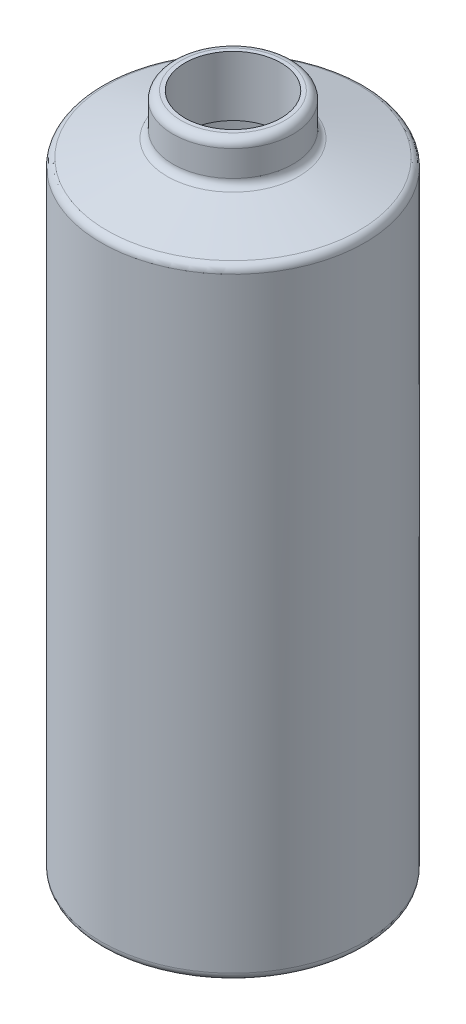
ISO-10303-21;
HEADER;
FILE_DESCRIPTION(('STEP AP214'),'2;1');
FILE_NAME('part.step','',(''),(''),'','','');
FILE_SCHEMA(('AUTOMOTIVE_DESIGN { 1 0 10303 214 1 1 1 1 }'));
ENDSEC;
DATA;
#1=APPLICATION_CONTEXT('core data for automotive mechanical design processes');
#2=APPLICATION_PROTOCOL_DEFINITION('international standard','automotive_design',2000,#1);
#3=PRODUCT_CONTEXT('',#1,'mechanical');
#4=PRODUCT('Part','Part','',(#3));
#5=PRODUCT_RELATED_PRODUCT_CATEGORY('part','',(#4));
#6=PRODUCT_DEFINITION_FORMATION('','',#4);
#7=PRODUCT_DEFINITION_CONTEXT('part definition',#1,'design');
#8=PRODUCT_DEFINITION('design','',#6,#7);
#9=PRODUCT_DEFINITION_SHAPE('','',#8);
#10=(LENGTH_UNIT() NAMED_UNIT(*) SI_UNIT(.MILLI.,.METRE.));
#11=(NAMED_UNIT(*) PLANE_ANGLE_UNIT() SI_UNIT($,.RADIAN.));
#12=(NAMED_UNIT(*) SI_UNIT($,.STERADIAN.) SOLID_ANGLE_UNIT());
#13=UNCERTAINTY_MEASURE_WITH_UNIT(LENGTH_MEASURE(1.E-05),#10,'distance_accuracy_value','');
#14=(GEOMETRIC_REPRESENTATION_CONTEXT(3) GLOBAL_UNCERTAINTY_ASSIGNED_CONTEXT((#13)) GLOBAL_UNIT_ASSIGNED_CONTEXT((#10,
#11,#12)) REPRESENTATION_CONTEXT('',''));
#15=CARTESIAN_POINT('',(0.,0.,0.));
#16=DIRECTION('',(0.,0.,1.));
#17=DIRECTION('',(1.,0.,0.));
#18=AXIS2_PLACEMENT_3D('',#15,#16,#17);
#19=CARTESIAN_POINT('',(0.,3.81,0.));
#20=DIRECTION('',(0.,1.,0.));
#21=DIRECTION('',(0.,0.,1.));
#22=AXIS2_PLACEMENT_3D('',#19,#20,#21);
#23=PLANE('',#22);
#24=CARTESIAN_POINT('',(0.,3.81000000000001,0.));
#25=DIRECTION('',(0.,1.,0.));
#26=DIRECTION('',(0.,0.,1.));
#27=AXIS2_PLACEMENT_3D('',#24,#25,#26);
#28=CIRCLE('',#27,38.1);
#29=CARTESIAN_POINT('',(0.,3.81000000000001,38.1));
#30=VERTEX_POINT('',#29);
#31=EDGE_CURVE('E68',#30,#30,#28,.T.);
#32=ORIENTED_EDGE('',*,*,#31,.T.);
#33=EDGE_LOOP('',(#32));
#34=FACE_BOUND('',#33,.T.);
#35=ADVANCED_FACE('F36',(#34),#23,.T.);
#36=CARTESIAN_POINT('',(0.,196.85,0.));
#37=DIRECTION('',(0.,-1.,0.));
#38=DIRECTION('',(0.,0.,-1.));
#39=AXIS2_PLACEMENT_3D('',#36,#37,#38);
#40=CYLINDRICAL_SURFACE('',#39,38.1);
#41=CARTESIAN_POINT('',(0.,196.85,0.));
#42=DIRECTION('',(0.,1.,0.));
#43=DIRECTION('',(0.,0.,1.));
#44=AXIS2_PLACEMENT_3D('',#41,#42,#43);
#45=CIRCLE('',#44,38.1);
#46=CARTESIAN_POINT('',(0.,196.85,38.1));
#47=VERTEX_POINT('',#46);
#48=EDGE_CURVE('E71',#47,#47,#45,.T.);
#49=ORIENTED_EDGE('',*,*,#48,.T.);
#50=EDGE_LOOP('',(#49));
#51=FACE_BOUND('',#50,.T.);
#52=ORIENTED_EDGE('',*,*,#31,.F.);
#53=EDGE_LOOP('',(#52));
#54=FACE_BOUND('',#53,.T.);
#55=ADVANCED_FACE('F102',(#51,#54),#40,.F.);
#56=CARTESIAN_POINT('',(0.,196.85,0.));
#57=DIRECTION('',(0.,1.,0.));
#58=DIRECTION('',(0.,0.,1.));
#59=AXIS2_PLACEMENT_3D('',#56,#57,#58);
#60=PLANE('',#59);
#61=CARTESIAN_POINT('',(0.,196.85,0.));
#62=DIRECTION('',(0.,1.,0.));
#63=DIRECTION('',(0.,0.,1.));
#64=AXIS2_PLACEMENT_3D('',#61,#62,#63);
#65=CIRCLE('',#64,15.24);
#66=CARTESIAN_POINT('',(0.,196.85,15.24));
#67=VERTEX_POINT('',#66);
#68=EDGE_CURVE('E74',#67,#67,#65,.F.);
#69=ORIENTED_EDGE('',*,*,#68,.F.);
#70=EDGE_LOOP('',(#69));
#71=FACE_BOUND('',#70,.T.);
#72=ORIENTED_EDGE('',*,*,#48,.F.);
#73=EDGE_LOOP('',(#72));
#74=FACE_BOUND('',#73,.T.);
#75=ADVANCED_FACE('F108',(#71,#74),#60,.F.);
#76=CARTESIAN_POINT('',(0.,-0.001000000000001,0.));
#77=DIRECTION('',(0.,1.,0.));
#78=DIRECTION('',(0.,0.,1.));
#79=AXIS2_PLACEMENT_3D('',#76,#77,#78);
#80=CYLINDRICAL_SURFACE('',#79,15.24);
#81=CARTESIAN_POINT('',(0.,215.9,0.));
#82=DIRECTION('',(0.,1.,0.));
#83=DIRECTION('',(0.,0.,1.));
#84=AXIS2_PLACEMENT_3D('',#81,#82,#83);
#85=CIRCLE('',#84,15.24);
#86=CARTESIAN_POINT('',(0.,215.9,15.24));
#87=VERTEX_POINT('',#86);
#88=EDGE_CURVE('E77',#87,#87,#85,.T.);
#89=ORIENTED_EDGE('',*,*,#88,.T.);
#90=EDGE_LOOP('',(#89));
#91=FACE_BOUND('',#90,.T.);
#92=ORIENTED_EDGE('',*,*,#68,.T.);
#93=EDGE_LOOP('',(#92));
#94=FACE_BOUND('',#93,.T.);
#95=ADVANCED_FACE('F81',(#91,#94),#80,.F.);
#96=CARTESIAN_POINT('',(0.,196.85,0.));
#97=DIRECTION('',(0.,-1.,0.));
#98=DIRECTION('',(0.,0.,-1.));
#99=AXIS2_PLACEMENT_3D('',#96,#97,#98);
#100=CYLINDRICAL_SURFACE('',#99,41.91);
#101=CARTESIAN_POINT('',(0.,2.53999999999999,0.));
#102=DIRECTION('',(0.,1.,0.));
#103=DIRECTION('',(0.,0.,1.));
#104=AXIS2_PLACEMENT_3D('',#101,#102,#103);
#105=CIRCLE('',#104,41.91);
#106=CARTESIAN_POINT('',(0.,2.53999999999999,41.91));
#107=VERTEX_POINT('',#106);
#108=EDGE_CURVE('E51',#107,#107,#105,.T.);
#109=ORIENTED_EDGE('',*,*,#108,.T.);
#110=EDGE_LOOP('',(#109));
#111=FACE_BOUND('',#110,.T.);
#112=CARTESIAN_POINT('',(0.,194.919382450091,0.));
#113=DIRECTION('',(0.,-1.,0.));
#114=DIRECTION('',(0.,0.,-1.));
#115=AXIS2_PLACEMENT_3D('',#112,#113,#114);
#116=CIRCLE('',#115,41.91);
#117=CARTESIAN_POINT('',(0.,194.919382450091,-41.91));
#118=VERTEX_POINT('',#117);
#119=EDGE_CURVE('E56',#118,#118,#116,.T.);
#120=ORIENTED_EDGE('',*,*,#119,.T.);
#121=EDGE_LOOP('',(#120));
#122=FACE_BOUND('',#121,.T.);
#123=ADVANCED_FACE('F116',(#111,#122),#100,.T.);
#124=CARTESIAN_POINT('',(0.,0.,0.));
#125=DIRECTION('',(0.,1.,0.));
#126=DIRECTION('',(0.,0.,1.));
#127=AXIS2_PLACEMENT_3D('',#124,#125,#126);
#128=PLANE('',#127);
#129=CARTESIAN_POINT('',(0.,0.,0.));
#130=DIRECTION('',(0.,1.,0.));
#131=DIRECTION('',(0.,0.,1.));
#132=AXIS2_PLACEMENT_3D('',#129,#130,#131);
#133=CIRCLE('',#132,39.37);
#134=CARTESIAN_POINT('',(0.,0.,39.37));
#135=VERTEX_POINT('',#134);
#136=EDGE_CURVE('E47',#135,#135,#133,.F.);
#137=ORIENTED_EDGE('',*,*,#136,.T.);
#138=EDGE_LOOP('',(#137));
#139=FACE_BOUND('',#138,.T.);
#140=ADVANCED_FACE('F113',(#139),#128,.F.);
#141=CARTESIAN_POINT('',(0.,203.2,0.));
#142=DIRECTION('',(0.,-1.,0.));
#143=DIRECTION('',(0.,0.,-1.));
#144=AXIS2_PLACEMENT_3D('',#141,#142,#143);
#145=CONICAL_SURFACE('',#144,19.05,1.29984947645648);
#146=CARTESIAN_POINT('',(0.,197.366717940551,0.));
#147=DIRECTION('',(0.,-1.,0.));
#148=DIRECTION('',(0.,0.,-1.));
#149=AXIS2_PLACEMENT_3D('',#146,#147,#148);
#150=CIRCLE('',#149,40.0498154140167);
#151=CARTESIAN_POINT('',(0.,197.366717940551,-40.0498154140167));
#152=VERTEX_POINT('',#151);
#153=EDGE_CURVE('E11',#152,#152,#150,.F.);
#154=ORIENTED_EDGE('',*,*,#153,.T.);
#155=EDGE_LOOP('',(#154));
#156=FACE_BOUND('',#155,.T.);
#157=CARTESIAN_POINT('',(0.,202.683282059449,0.));
#158=DIRECTION('',(0.,1.,0.));
#159=DIRECTION('',(0.,0.,1.));
#160=AXIS2_PLACEMENT_3D('',#157,#158,#159);
#161=CIRCLE('',#160,20.9101845859833);
#162=CARTESIAN_POINT('',(0.,202.683282059449,20.9101845859833));
#163=VERTEX_POINT('',#162);
#164=EDGE_CURVE('E43',#163,#163,#161,.F.);
#165=ORIENTED_EDGE('',*,*,#164,.T.);
#166=EDGE_LOOP('',(#165));
#167=FACE_BOUND('',#166,.T.);
#168=ADVANCED_FACE('F97',(#156,#167),#145,.T.);
#169=CARTESIAN_POINT('',(0.,215.9,0.));
#170=DIRECTION('',(0.,-1.,0.));
#171=DIRECTION('',(0.,0.,-1.));
#172=AXIS2_PLACEMENT_3D('',#169,#170,#171);
#173=CYLINDRICAL_SURFACE('',#172,19.05);
#174=CARTESIAN_POINT('',(0.,213.36,0.));
#175=DIRECTION('',(0.,1.,0.));
#176=DIRECTION('',(0.,0.,1.));
#177=AXIS2_PLACEMENT_3D('',#174,#175,#176);
#178=CIRCLE('',#177,19.05);
#179=CARTESIAN_POINT('',(0.,213.36,19.05));
#180=VERTEX_POINT('',#179);
#181=EDGE_CURVE('E59',#180,#180,#178,.F.);
#182=ORIENTED_EDGE('',*,*,#181,.T.);
#183=EDGE_LOOP('',(#182));
#184=FACE_BOUND('',#183,.T.);
#185=CARTESIAN_POINT('',(0.,205.130617549909,0.));
#186=DIRECTION('',(0.,1.,0.));
#187=DIRECTION('',(0.,0.,1.));
#188=AXIS2_PLACEMENT_3D('',#185,#186,#187);
#189=CIRCLE('',#188,19.05);
#190=CARTESIAN_POINT('',(0.,205.130617549909,19.05));
#191=VERTEX_POINT('',#190);
#192=EDGE_CURVE('E62',#191,#191,#189,.T.);
#193=ORIENTED_EDGE('',*,*,#192,.T.);
#194=EDGE_LOOP('',(#193));
#195=FACE_BOUND('',#194,.T.);
#196=ADVANCED_FACE('F87',(#184,#195),#173,.T.);
#197=CARTESIAN_POINT('',(0.,215.9,0.));
#198=DIRECTION('',(0.,1.,0.));
#199=DIRECTION('',(0.,0.,1.));
#200=AXIS2_PLACEMENT_3D('',#197,#198,#199);
#201=PLANE('',#200);
#202=CARTESIAN_POINT('',(0.,215.9,0.));
#203=DIRECTION('',(0.,1.,0.));
#204=DIRECTION('',(0.,0.,1.));
#205=AXIS2_PLACEMENT_3D('',#202,#203,#204);
#206=CIRCLE('',#205,16.51);
#207=CARTESIAN_POINT('',(0.,215.9,16.51));
#208=VERTEX_POINT('',#207);
#209=EDGE_CURVE('E65',#208,#208,#206,.T.);
#210=ORIENTED_EDGE('',*,*,#209,.T.);
#211=EDGE_LOOP('',(#210));
#212=FACE_BOUND('',#211,.T.);
#213=ORIENTED_EDGE('',*,*,#88,.F.);
#214=EDGE_LOOP('',(#213));
#215=FACE_BOUND('',#214,.T.);
#216=ADVANCED_FACE('F84',(#212,#215),#201,.T.);
#217=CARTESIAN_POINT('',(0.,213.36,0.));
#218=DIRECTION('',(0.,1.,0.));
#219=DIRECTION('',(0.,0.,1.));
#220=AXIS2_PLACEMENT_3D('',#217,#218,#219);
#221=TOROIDAL_SURFACE('',#220,16.51,2.54);
#222=ORIENTED_EDGE('',*,*,#181,.F.);
#223=EDGE_LOOP('',(#222));
#224=FACE_BOUND('',#223,.T.);
#225=ORIENTED_EDGE('',*,*,#209,.F.);
#226=EDGE_LOOP('',(#225));
#227=FACE_BOUND('',#226,.T.);
#228=ADVANCED_FACE('F86',(#224,#227),#221,.T.);
#229=CARTESIAN_POINT('',(0.,2.53999999999999,0.));
#230=DIRECTION('',(0.,1.,0.));
#231=DIRECTION('',(0.,0.,1.));
#232=AXIS2_PLACEMENT_3D('',#229,#230,#231);
#233=TOROIDAL_SURFACE('',#232,39.37,2.54);
#234=ORIENTED_EDGE('',*,*,#136,.F.);
#235=EDGE_LOOP('',(#234));
#236=FACE_BOUND('',#235,.T.);
#237=ORIENTED_EDGE('',*,*,#108,.F.);
#238=EDGE_LOOP('',(#237));
#239=FACE_BOUND('',#238,.T.);
#240=ADVANCED_FACE('F94',(#236,#239),#233,.T.);
#241=CARTESIAN_POINT('',(0.,194.919382450091,0.));
#242=DIRECTION('',(0.,-1.,0.));
#243=DIRECTION('',(0.,0.,-1.));
#244=AXIS2_PLACEMENT_3D('',#241,#242,#243);
#245=TOROIDAL_SURFACE('',#244,39.37,2.54);
#246=ORIENTED_EDGE('',*,*,#119,.F.);
#247=EDGE_LOOP('',(#246));
#248=FACE_BOUND('',#247,.T.);
#249=ORIENTED_EDGE('',*,*,#153,.F.);
#250=EDGE_LOOP('',(#249));
#251=FACE_BOUND('',#250,.T.);
#252=ADVANCED_FACE('F122',(#248,#251),#245,.T.);
#253=CARTESIAN_POINT('',(0.,205.130617549909,0.));
#254=DIRECTION('',(0.,1.,0.));
#255=DIRECTION('',(0.,0.,1.));
#256=AXIS2_PLACEMENT_3D('',#253,#254,#255);
#257=TOROIDAL_SURFACE('',#256,21.59,2.54);
#258=ORIENTED_EDGE('',*,*,#164,.F.);
#259=EDGE_LOOP('',(#258));
#260=FACE_BOUND('',#259,.T.);
#261=ORIENTED_EDGE('',*,*,#192,.F.);
#262=EDGE_LOOP('',(#261));
#263=FACE_BOUND('',#262,.T.);
#264=ADVANCED_FACE('F38',(#260,#263),#257,.F.);
#265=CLOSED_SHELL('',(#35,#55,#75,#95,#123,#140,#168,#196,#216,#228,#240,#252,#264));
#266=MANIFOLD_SOLID_BREP('B2',#265);
#267=ADVANCED_BREP_SHAPE_REPRESENTATION('',(#18,#266),#14);
#268=SHAPE_DEFINITION_REPRESENTATION(#9,#267);
ENDSEC;
END-ISO-10303-21;
